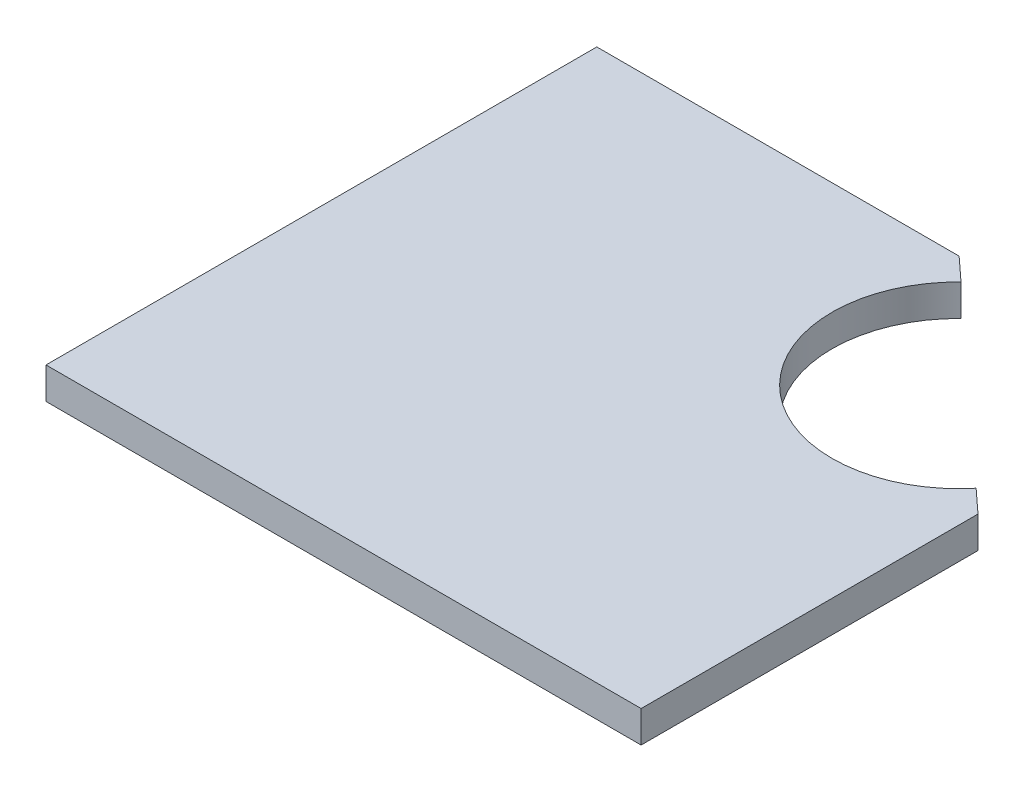
ISO-10303-21;
HEADER;
FILE_DESCRIPTION(('STEP AP214'),'2;1');
FILE_NAME('part.step','',(''),(''),'','','');
FILE_SCHEMA(('AUTOMOTIVE_DESIGN { 1 0 10303 214 1 1 1 1 }'));
ENDSEC;
DATA;
#1=APPLICATION_CONTEXT('core data for automotive mechanical design processes');
#2=APPLICATION_PROTOCOL_DEFINITION('international standard','automotive_design',2000,#1);
#3=PRODUCT_CONTEXT('',#1,'mechanical');
#4=PRODUCT('Part','Part','',(#3));
#5=PRODUCT_RELATED_PRODUCT_CATEGORY('part','',(#4));
#6=PRODUCT_DEFINITION_FORMATION('','',#4);
#7=PRODUCT_DEFINITION_CONTEXT('part definition',#1,'design');
#8=PRODUCT_DEFINITION('design','',#6,#7);
#9=PRODUCT_DEFINITION_SHAPE('','',#8);
#10=(LENGTH_UNIT() NAMED_UNIT(*) SI_UNIT(.MILLI.,.METRE.));
#11=(NAMED_UNIT(*) PLANE_ANGLE_UNIT() SI_UNIT($,.RADIAN.));
#12=(NAMED_UNIT(*) SI_UNIT($,.STERADIAN.) SOLID_ANGLE_UNIT());
#13=UNCERTAINTY_MEASURE_WITH_UNIT(LENGTH_MEASURE(1.E-05),#10,'distance_accuracy_value','');
#14=(GEOMETRIC_REPRESENTATION_CONTEXT(3) GLOBAL_UNCERTAINTY_ASSIGNED_CONTEXT((#13)) GLOBAL_UNIT_ASSIGNED_CONTEXT((#10,
#11,#12)) REPRESENTATION_CONTEXT('',''));
#15=CARTESIAN_POINT('',(0.,0.,0.));
#16=DIRECTION('',(0.,0.,1.));
#17=DIRECTION('',(1.,0.,0.));
#18=AXIS2_PLACEMENT_3D('',#15,#16,#17);
#19=CARTESIAN_POINT('',(27.864936083201,5.,-25.7898876514732));
#20=DIRECTION('',(0.,-1.,0.));
#21=DIRECTION('',(0.,0.,-1.));
#22=AXIS2_PLACEMENT_3D('',#19,#20,#21);
#23=CYLINDRICAL_SURFACE('',#22,20.);
#24=CARTESIAN_POINT('',(27.864936083201,0.,-25.7898876514732));
#25=DIRECTION('',(0.,1.,0.));
#26=DIRECTION('',(0.,0.,1.));
#27=AXIS2_PLACEMENT_3D('',#24,#25,#26);
#28=CIRCLE('',#27,20.);
#29=CARTESIAN_POINT('',(13.9101375353481,0.,-40.116910981141));
#30=VERTEX_POINT('',#29);
#31=CARTESIAN_POINT('',(43.3183280034099,0.,-13.0937197981239));
#32=VERTEX_POINT('',#31);
#33=EDGE_CURVE('E122',#30,#32,#28,.T.);
#34=ORIENTED_EDGE('',*,*,#33,.F.);
#35=DIRECTION('',(0.,-1.,0.));
#36=VECTOR('',#35,1.);
#37=CARTESIAN_POINT('',(13.9101375353481,5.,-40.116910981141));
#38=LINE('',#37,#36);
#39=CARTESIAN_POINT('',(13.9101375353481,5.,-40.116910981141));
#40=VERTEX_POINT('',#39);
#41=EDGE_CURVE('E11',#40,#30,#38,.T.);
#42=ORIENTED_EDGE('',*,*,#41,.F.);
#43=CARTESIAN_POINT('',(27.864936083201,5.,-25.7898876514732));
#44=DIRECTION('',(0.,1.,0.));
#45=DIRECTION('',(0.,0.,1.));
#46=AXIS2_PLACEMENT_3D('',#43,#44,#45);
#47=CIRCLE('',#46,20.);
#48=CARTESIAN_POINT('',(43.3183280034099,5.,-13.0937197981239));
#49=VERTEX_POINT('',#48);
#50=EDGE_CURVE('E139',#40,#49,#47,.T.);
#51=ORIENTED_EDGE('',*,*,#50,.T.);
#52=DIRECTION('',(0.,-1.,0.));
#53=VECTOR('',#52,1.);
#54=CARTESIAN_POINT('',(43.3183280034099,5.,-13.0937197981239));
#55=LINE('',#54,#53);
#56=EDGE_CURVE('E51',#49,#32,#55,.T.);
#57=ORIENTED_EDGE('',*,*,#56,.T.);
#58=EDGE_LOOP('',(#34,#42,#51,#57));
#59=FACE_BOUND('',#58,.T.);
#60=ADVANCED_FACE('F35',(#59),#23,.F.);
#61=CARTESIAN_POINT('',(26.3551486483267,5.,-28.6811881696327));
#62=DIRECTION('',(0.676617803771802,0.,-0.736334399318016));
#63=DIRECTION('',(-0.736334399318016,0.,-0.676617803771802));
#64=AXIS2_PLACEMENT_3D('',#61,#62,#63);
#65=PLANE('',#64);
#66=DIRECTION('',(0.736334399318016,0.,0.676617803771802));
#67=VECTOR('',#66,1.);
#68=CARTESIAN_POINT('',(26.3551486483267,0.,-28.6811881696327));
#69=LINE('',#68,#67);
#70=CARTESIAN_POINT('',(10.228465538758,0.,-43.5));
#71=VERTEX_POINT('',#70);
#72=EDGE_CURVE('E124',#71,#30,#69,.T.);
#73=ORIENTED_EDGE('',*,*,#72,.F.);
#74=DIRECTION('',(0.,-1.,0.));
#75=VECTOR('',#74,1.);
#76=CARTESIAN_POINT('',(10.228465538758,5.,-43.5));
#77=LINE('',#76,#75);
#78=CARTESIAN_POINT('',(10.228465538758,5.,-43.5));
#79=VERTEX_POINT('',#78);
#80=EDGE_CURVE('E43',#79,#71,#77,.T.);
#81=ORIENTED_EDGE('',*,*,#80,.F.);
#82=DIRECTION('',(0.736334399318016,0.,0.676617803771802));
#83=VECTOR('',#82,1.);
#84=CARTESIAN_POINT('',(26.3551486483267,5.,-28.6811881696327));
#85=LINE('',#84,#83);
#86=EDGE_CURVE('E159',#79,#40,#85,.T.);
#87=ORIENTED_EDGE('',*,*,#86,.T.);
#88=ORIENTED_EDGE('',*,*,#41,.T.);
#89=EDGE_LOOP('',(#73,#81,#87,#88));
#90=FACE_BOUND('',#89,.T.);
#91=ADVANCED_FACE('F153',(#90),#65,.T.);
#92=CARTESIAN_POINT('',(0.,5.,-43.5));
#93=DIRECTION('',(0.,0.,-1.));
#94=DIRECTION('',(-1.,0.,0.));
#95=AXIS2_PLACEMENT_3D('',#92,#93,#94);
#96=PLANE('',#95);
#97=DIRECTION('',(1.,0.,0.));
#98=VECTOR('',#97,1.);
#99=CARTESIAN_POINT('',(0.,0.,-43.5));
#100=LINE('',#99,#98);
#101=CARTESIAN_POINT('',(-47.,0.,-43.5));
#102=VERTEX_POINT('',#101);
#103=EDGE_CURVE('E127',#102,#71,#100,.T.);
#104=ORIENTED_EDGE('',*,*,#103,.F.);
#105=DIRECTION('',(0.,-1.,0.));
#106=VECTOR('',#105,1.);
#107=CARTESIAN_POINT('',(-47.,5.,-43.5));
#108=LINE('',#107,#106);
#109=CARTESIAN_POINT('',(-47.,5.,-43.5));
#110=VERTEX_POINT('',#109);
#111=EDGE_CURVE('E143',#110,#102,#108,.T.);
#112=ORIENTED_EDGE('',*,*,#111,.F.);
#113=DIRECTION('',(1.,0.,0.));
#114=VECTOR('',#113,1.);
#115=CARTESIAN_POINT('',(0.,5.,-43.5));
#116=LINE('',#115,#114);
#117=EDGE_CURVE('E149',#110,#79,#116,.T.);
#118=ORIENTED_EDGE('',*,*,#117,.T.);
#119=ORIENTED_EDGE('',*,*,#80,.T.);
#120=EDGE_LOOP('',(#104,#112,#118,#119));
#121=FACE_BOUND('',#120,.T.);
#122=ADVANCED_FACE('F148',(#121),#96,.T.);
#123=CARTESIAN_POINT('',(-47.,5.,0.));
#124=DIRECTION('',(-1.,0.,0.));
#125=DIRECTION('',(0.,0.,1.));
#126=AXIS2_PLACEMENT_3D('',#123,#124,#125);
#127=PLANE('',#126);
#128=DIRECTION('',(0.,0.,-1.));
#129=VECTOR('',#128,1.);
#130=CARTESIAN_POINT('',(-47.,0.,0.));
#131=LINE('',#130,#129);
#132=CARTESIAN_POINT('',(-47.,0.,43.5));
#133=VERTEX_POINT('',#132);
#134=EDGE_CURVE('E130',#133,#102,#131,.T.);
#135=ORIENTED_EDGE('',*,*,#134,.F.);
#136=DIRECTION('',(0.,-1.,0.));
#137=VECTOR('',#136,1.);
#138=CARTESIAN_POINT('',(-47.,5.,43.5));
#139=LINE('',#138,#137);
#140=CARTESIAN_POINT('',(-47.,5.,43.5));
#141=VERTEX_POINT('',#140);
#142=EDGE_CURVE('E104',#141,#133,#139,.T.);
#143=ORIENTED_EDGE('',*,*,#142,.F.);
#144=DIRECTION('',(0.,0.,-1.));
#145=VECTOR('',#144,1.);
#146=CARTESIAN_POINT('',(-47.,5.,0.));
#147=LINE('',#146,#145);
#148=EDGE_CURVE('E114',#141,#110,#147,.T.);
#149=ORIENTED_EDGE('',*,*,#148,.T.);
#150=ORIENTED_EDGE('',*,*,#111,.T.);
#151=EDGE_LOOP('',(#135,#143,#149,#150));
#152=FACE_BOUND('',#151,.T.);
#153=ADVANCED_FACE('F158',(#152),#127,.T.);
#154=CARTESIAN_POINT('',(0.,5.,43.5));
#155=DIRECTION('',(0.,0.,1.));
#156=DIRECTION('',(1.,0.,0.));
#157=AXIS2_PLACEMENT_3D('',#154,#155,#156);
#158=PLANE('',#157);
#159=DIRECTION('',(-1.,0.,0.));
#160=VECTOR('',#159,1.);
#161=CARTESIAN_POINT('',(0.,0.,43.5));
#162=LINE('',#161,#160);
#163=CARTESIAN_POINT('',(47.,0.,43.5));
#164=VERTEX_POINT('',#163);
#165=EDGE_CURVE('E100',#164,#133,#162,.T.);
#166=ORIENTED_EDGE('',*,*,#165,.F.);
#167=DIRECTION('',(0.,-1.,0.));
#168=VECTOR('',#167,1.);
#169=CARTESIAN_POINT('',(47.,5.,43.5));
#170=LINE('',#169,#168);
#171=CARTESIAN_POINT('',(47.,5.,43.5));
#172=VERTEX_POINT('',#171);
#173=EDGE_CURVE('E95',#172,#164,#170,.T.);
#174=ORIENTED_EDGE('',*,*,#173,.F.);
#175=DIRECTION('',(-1.,0.,0.));
#176=VECTOR('',#175,1.);
#177=CARTESIAN_POINT('',(0.,5.,43.5));
#178=LINE('',#177,#176);
#179=EDGE_CURVE('E98',#172,#141,#178,.T.);
#180=ORIENTED_EDGE('',*,*,#179,.T.);
#181=ORIENTED_EDGE('',*,*,#142,.T.);
#182=EDGE_LOOP('',(#166,#174,#180,#181));
#183=FACE_BOUND('',#182,.T.);
#184=ADVANCED_FACE('F97',(#183),#158,.T.);
#185=CARTESIAN_POINT('',(47.,5.,0.));
#186=DIRECTION('',(1.,0.,0.));
#187=DIRECTION('',(0.,0.,-1.));
#188=AXIS2_PLACEMENT_3D('',#185,#186,#187);
#189=PLANE('',#188);
#190=DIRECTION('',(0.,0.,1.));
#191=VECTOR('',#190,1.);
#192=CARTESIAN_POINT('',(47.,0.,0.));
#193=LINE('',#192,#191);
#194=CARTESIAN_POINT('',(47.,0.,-9.7106307792649));
#195=VERTEX_POINT('',#194);
#196=EDGE_CURVE('E134',#195,#164,#193,.T.);
#197=ORIENTED_EDGE('',*,*,#196,.F.);
#198=DIRECTION('',(0.,-1.,0.));
#199=VECTOR('',#198,1.);
#200=CARTESIAN_POINT('',(47.,5.,-9.7106307792649));
#201=LINE('',#200,#199);
#202=CARTESIAN_POINT('',(47.,5.,-9.7106307792649));
#203=VERTEX_POINT('',#202);
#204=EDGE_CURVE('E73',#203,#195,#201,.T.);
#205=ORIENTED_EDGE('',*,*,#204,.F.);
#206=DIRECTION('',(0.,0.,1.));
#207=VECTOR('',#206,1.);
#208=CARTESIAN_POINT('',(47.,5.,0.));
#209=LINE('',#208,#207);
#210=EDGE_CURVE('E111',#203,#172,#209,.T.);
#211=ORIENTED_EDGE('',*,*,#210,.T.);
#212=ORIENTED_EDGE('',*,*,#173,.T.);
#213=EDGE_LOOP('',(#197,#205,#211,#212));
#214=FACE_BOUND('',#213,.T.);
#215=ADVANCED_FACE('F116',(#214),#189,.T.);
#216=CARTESIAN_POINT('',(26.3551486483267,5.,-28.6811881696328));
#217=DIRECTION('',(0.676617803771801,0.,-0.736334399318017));
#218=DIRECTION('',(-0.736334399318017,0.,-0.676617803771801));
#219=AXIS2_PLACEMENT_3D('',#216,#217,#218);
#220=PLANE('',#219);
#221=DIRECTION('',(0.736334399318017,0.,0.676617803771801));
#222=VECTOR('',#221,1.);
#223=CARTESIAN_POINT('',(26.3551486483267,0.,-28.6811881696328));
#224=LINE('',#223,#222);
#225=EDGE_CURVE('E136',#32,#195,#224,.T.);
#226=ORIENTED_EDGE('',*,*,#225,.F.);
#227=ORIENTED_EDGE('',*,*,#56,.F.);
#228=DIRECTION('',(0.736334399318017,0.,0.676617803771801));
#229=VECTOR('',#228,1.);
#230=CARTESIAN_POINT('',(26.3551486483267,5.,-28.6811881696328));
#231=LINE('',#230,#229);
#232=EDGE_CURVE('E117',#49,#203,#231,.T.);
#233=ORIENTED_EDGE('',*,*,#232,.T.);
#234=ORIENTED_EDGE('',*,*,#204,.T.);
#235=EDGE_LOOP('',(#226,#227,#233,#234));
#236=FACE_BOUND('',#235,.T.);
#237=ADVANCED_FACE('F163',(#236),#220,.T.);
#238=CARTESIAN_POINT('',(0.,5.,0.));
#239=DIRECTION('',(0.,1.,0.));
#240=DIRECTION('',(0.,0.,1.));
#241=AXIS2_PLACEMENT_3D('',#238,#239,#240);
#242=PLANE('',#241);
#243=ORIENTED_EDGE('',*,*,#50,.F.);
#244=ORIENTED_EDGE('',*,*,#86,.F.);
#245=ORIENTED_EDGE('',*,*,#117,.F.);
#246=ORIENTED_EDGE('',*,*,#148,.F.);
#247=ORIENTED_EDGE('',*,*,#179,.F.);
#248=ORIENTED_EDGE('',*,*,#210,.F.);
#249=ORIENTED_EDGE('',*,*,#232,.F.);
#250=EDGE_LOOP('',(#243,#244,#245,#246,#247,#248,#249));
#251=FACE_BOUND('',#250,.T.);
#252=ADVANCED_FACE('F109',(#251),#242,.T.);
#253=CARTESIAN_POINT('',(0.,0.,0.));
#254=DIRECTION('',(0.,1.,0.));
#255=DIRECTION('',(0.,0.,1.));
#256=AXIS2_PLACEMENT_3D('',#253,#254,#255);
#257=PLANE('',#256);
#258=ORIENTED_EDGE('',*,*,#33,.T.);
#259=ORIENTED_EDGE('',*,*,#225,.T.);
#260=ORIENTED_EDGE('',*,*,#196,.T.);
#261=ORIENTED_EDGE('',*,*,#165,.T.);
#262=ORIENTED_EDGE('',*,*,#134,.T.);
#263=ORIENTED_EDGE('',*,*,#103,.T.);
#264=ORIENTED_EDGE('',*,*,#72,.T.);
#265=EDGE_LOOP('',(#258,#259,#260,#261,#262,#263,#264));
#266=FACE_BOUND('',#265,.T.);
#267=ADVANCED_FACE('F155',(#266),#257,.F.);
#268=CLOSED_SHELL('',(#60,#91,#122,#153,#184,#215,#237,#252,#267));
#269=MANIFOLD_SOLID_BREP('B2',#268);
#270=ADVANCED_BREP_SHAPE_REPRESENTATION('',(#18,#269),#14);
#271=SHAPE_DEFINITION_REPRESENTATION(#9,#270);
ENDSEC;
END-ISO-10303-21;
